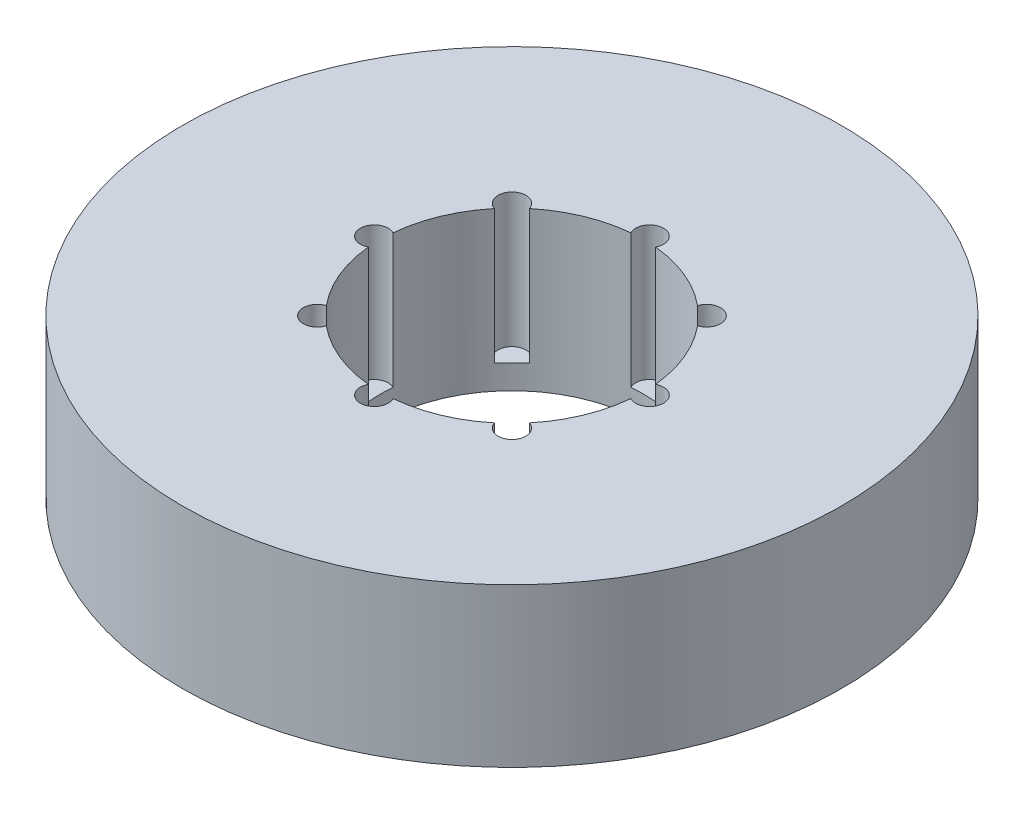
ISO-10303-21;
HEADER;
FILE_DESCRIPTION(('STEP AP214'),'2;1');
FILE_NAME('part.step','',(''),(''),'','','');
FILE_SCHEMA(('AUTOMOTIVE_DESIGN { 1 0 10303 214 1 1 1 1 }'));
ENDSEC;
DATA;
#1=APPLICATION_CONTEXT('core data for automotive mechanical design processes');
#2=APPLICATION_PROTOCOL_DEFINITION('international standard','automotive_design',2000,#1);
#3=PRODUCT_CONTEXT('',#1,'mechanical');
#4=PRODUCT('Part','Part','',(#3));
#5=PRODUCT_RELATED_PRODUCT_CATEGORY('part','',(#4));
#6=PRODUCT_DEFINITION_FORMATION('','',#4);
#7=PRODUCT_DEFINITION_CONTEXT('part definition',#1,'design');
#8=PRODUCT_DEFINITION('design','',#6,#7);
#9=PRODUCT_DEFINITION_SHAPE('','',#8);
#10=(LENGTH_UNIT() NAMED_UNIT(*) SI_UNIT(.MILLI.,.METRE.));
#11=(NAMED_UNIT(*) PLANE_ANGLE_UNIT() SI_UNIT($,.RADIAN.));
#12=(NAMED_UNIT(*) SI_UNIT($,.STERADIAN.) SOLID_ANGLE_UNIT());
#13=UNCERTAINTY_MEASURE_WITH_UNIT(LENGTH_MEASURE(1.E-05),#10,'distance_accuracy_value','');
#14=(GEOMETRIC_REPRESENTATION_CONTEXT(3) GLOBAL_UNCERTAINTY_ASSIGNED_CONTEXT((#13)) GLOBAL_UNIT_ASSIGNED_CONTEXT((#10,
#11,#12)) REPRESENTATION_CONTEXT('',''));
#15=CARTESIAN_POINT('',(0.,0.,0.));
#16=DIRECTION('',(0.,0.,1.));
#17=DIRECTION('',(1.,0.,0.));
#18=AXIS2_PLACEMENT_3D('',#15,#16,#17);
#19=CARTESIAN_POINT('',(0.,30.,0.));
#20=DIRECTION('',(0.,-1.,0.));
#21=DIRECTION('',(0.,0.,-1.));
#22=AXIS2_PLACEMENT_3D('',#19,#20,#21);
#23=CYLINDRICAL_SURFACE('',#22,62.5);
#24=CARTESIAN_POINT('',(0.,30.,0.));
#25=DIRECTION('',(0.,1.,0.));
#26=DIRECTION('',(0.,0.,1.));
#27=AXIS2_PLACEMENT_3D('',#24,#25,#26);
#28=CIRCLE('',#27,62.5);
#29=CARTESIAN_POINT('',(0.,30.,62.5));
#30=VERTEX_POINT('',#29);
#31=EDGE_CURVE('E195',#30,#30,#28,.T.);
#32=ORIENTED_EDGE('',*,*,#31,.F.);
#33=EDGE_LOOP('',(#32));
#34=FACE_BOUND('',#33,.T.);
#35=CARTESIAN_POINT('',(0.,0.,0.));
#36=DIRECTION('',(0.,1.,0.));
#37=DIRECTION('',(0.,0.,1.));
#38=AXIS2_PLACEMENT_3D('',#35,#36,#37);
#39=CIRCLE('',#38,62.5);
#40=CARTESIAN_POINT('',(0.,0.,62.5));
#41=VERTEX_POINT('',#40);
#42=EDGE_CURVE('E179',#41,#41,#39,.T.);
#43=ORIENTED_EDGE('',*,*,#42,.T.);
#44=EDGE_LOOP('',(#43));
#45=FACE_BOUND('',#44,.T.);
#46=ADVANCED_FACE('F39',(#34,#45),#23,.T.);
#47=CARTESIAN_POINT('',(0.,30.,0.));
#48=DIRECTION('',(0.,1.,0.));
#49=DIRECTION('',(0.,0.,1.));
#50=AXIS2_PLACEMENT_3D('',#47,#48,#49);
#51=PLANE('',#50);
#52=CARTESIAN_POINT('',(0.,30.,26.1063703880991));
#53=DIRECTION('',(0.,1.,0.));
#54=DIRECTION('',(1.,0.,0.));
#55=AXIS2_PLACEMENT_3D('',#52,#53,#54);
#56=CIRCLE('',#55,2.64043993435413);
#57=CARTESIAN_POINT('',(-2.34353536969357,30.,24.8899144629104));
#58=VERTEX_POINT('',#57);
#59=CARTESIAN_POINT('',(2.34353536969374,30.,24.8899144629104));
#60=VERTEX_POINT('',#59);
#61=EDGE_CURVE('E176',#58,#60,#56,.T.);
#62=ORIENTED_EDGE('',*,*,#61,.F.);
#63=CARTESIAN_POINT('',(0.,30.,0.));
#64=DIRECTION('',(0.,1.,0.));
#65=DIRECTION('',(0.,0.,1.));
#66=AXIS2_PLACEMENT_3D('',#63,#64,#65);
#67=CIRCLE('',#66,25.);
#68=CARTESIAN_POINT('',(-15.9426975480161,30.,19.256957051738));
#69=VERTEX_POINT('',#68);
#70=EDGE_CURVE('E166',#69,#58,#67,.T.);
#71=ORIENTED_EDGE('',*,*,#70,.F.);
#72=CARTESIAN_POINT('',(-18.4599915335926,30.,18.4599915335926));
#73=DIRECTION('',(0.,1.,0.));
#74=DIRECTION('',(0.707106781186549,0.,0.707106781186546));
#75=AXIS2_PLACEMENT_3D('',#72,#73,#74);
#76=CIRCLE('',#75,2.64043993435413);
#77=CARTESIAN_POINT('',(-19.2569570517379,30.,15.9426975480162));
#78=VERTEX_POINT('',#77);
#79=EDGE_CURVE('E147',#78,#69,#76,.T.);
#80=ORIENTED_EDGE('',*,*,#79,.F.);
#81=CARTESIAN_POINT('',(-24.8899144629104,30.,2.34353536969365));
#82=VERTEX_POINT('',#81);
#83=EDGE_CURVE('E180',#82,#78,#67,.T.);
#84=ORIENTED_EDGE('',*,*,#83,.F.);
#85=CARTESIAN_POINT('',(-26.1063703880991,30.,0.));
#86=DIRECTION('',(0.,1.,0.));
#87=DIRECTION('',(0.,0.,1.));
#88=AXIS2_PLACEMENT_3D('',#85,#86,#87);
#89=CIRCLE('',#88,2.64043993435413);
#90=CARTESIAN_POINT('',(-24.8899144629104,30.,-2.34353536969365));
#91=VERTEX_POINT('',#90);
#92=EDGE_CURVE('E186',#91,#82,#89,.T.);
#93=ORIENTED_EDGE('',*,*,#92,.F.);
#94=CARTESIAN_POINT('',(-19.2569570517381,30.,-15.9426975480159));
#95=VERTEX_POINT('',#94);
#96=EDGE_CURVE('E182',#95,#91,#67,.T.);
#97=ORIENTED_EDGE('',*,*,#96,.F.);
#98=CARTESIAN_POINT('',(-18.4599915335928,30.,-18.4599915335924));
#99=DIRECTION('',(0.,1.,0.));
#100=DIRECTION('',(-0.707106781186539,0.,0.707106781186556));
#101=AXIS2_PLACEMENT_3D('',#98,#99,#100);
#102=CIRCLE('',#101,2.64043993435413);
#103=CARTESIAN_POINT('',(-15.9426975480164,30.,-19.2569570517378));
#104=VERTEX_POINT('',#103);
#105=EDGE_CURVE('E446',#104,#95,#102,.T.);
#106=ORIENTED_EDGE('',*,*,#105,.F.);
#107=CARTESIAN_POINT('',(-2.34353536969392,30.,-24.8899144629103));
#108=VERTEX_POINT('',#107);
#109=EDGE_CURVE('E452',#108,#104,#67,.T.);
#110=ORIENTED_EDGE('',*,*,#109,.F.);
#111=CARTESIAN_POINT('',(-2.73449715104925E-13,30.,-26.1063703880991));
#112=DIRECTION('',(0.,1.,0.));
#113=DIRECTION('',(-1.,0.,0.));
#114=AXIS2_PLACEMENT_3D('',#111,#112,#113);
#115=CIRCLE('',#114,2.64043993435413);
#116=CARTESIAN_POINT('',(2.34353536969339,30.,-24.8899144629104));
#117=VERTEX_POINT('',#116);
#118=EDGE_CURVE('E477',#117,#108,#115,.T.);
#119=ORIENTED_EDGE('',*,*,#118,.F.);
#120=CARTESIAN_POINT('',(15.942697548016,30.,-19.2569570517381));
#121=VERTEX_POINT('',#120);
#122=EDGE_CURVE('E460',#121,#117,#67,.T.);
#123=ORIENTED_EDGE('',*,*,#122,.F.);
#124=CARTESIAN_POINT('',(18.4599915335924,30.,-18.4599915335927));
#125=DIRECTION('',(0.,1.,0.));
#126=DIRECTION('',(-0.707106781186554,0.,-0.707106781186541));
#127=AXIS2_PLACEMENT_3D('',#124,#125,#126);
#128=CIRCLE('',#127,2.64043993435413);
#129=CARTESIAN_POINT('',(19.2569570517378,30.,-15.9426975480163));
#130=VERTEX_POINT('',#129);
#131=EDGE_CURVE('E464',#130,#121,#128,.T.);
#132=ORIENTED_EDGE('',*,*,#131,.F.);
#133=CARTESIAN_POINT('',(24.8899144629104,30.,-2.34353536969365));
#134=VERTEX_POINT('',#133);
#135=EDGE_CURVE('E459',#134,#130,#67,.T.);
#136=ORIENTED_EDGE('',*,*,#135,.F.);
#137=CARTESIAN_POINT('',(26.1063703880991,30.,0.));
#138=DIRECTION('',(0.,1.,0.));
#139=DIRECTION('',(0.,0.,-1.));
#140=AXIS2_PLACEMENT_3D('',#137,#138,#139);
#141=CIRCLE('',#140,2.64043993435413);
#142=CARTESIAN_POINT('',(24.8899144629104,30.,2.34353536969365));
#143=VERTEX_POINT('',#142);
#144=EDGE_CURVE('E469',#143,#134,#141,.T.);
#145=ORIENTED_EDGE('',*,*,#144,.F.);
#146=CARTESIAN_POINT('',(19.256957051738,30.,15.942697548016));
#147=VERTEX_POINT('',#146);
#148=EDGE_CURVE('E181',#147,#143,#67,.T.);
#149=ORIENTED_EDGE('',*,*,#148,.F.);
#150=CARTESIAN_POINT('',(18.4599915335927,30.,18.4599915335925));
#151=DIRECTION('',(0.,1.,0.));
#152=DIRECTION('',(0.707106781186544,0.,-0.707106781186551));
#153=AXIS2_PLACEMENT_3D('',#150,#151,#152);
#154=CIRCLE('',#153,2.64043993435413);
#155=CARTESIAN_POINT('',(15.9426975480162,30.,19.2569570517379));
#156=VERTEX_POINT('',#155);
#157=EDGE_CURVE('E475',#156,#147,#154,.T.);
#158=ORIENTED_EDGE('',*,*,#157,.F.);
#159=EDGE_CURVE('E177',#60,#156,#67,.T.);
#160=ORIENTED_EDGE('',*,*,#159,.F.);
#161=EDGE_LOOP('',(#62,#71,#80,#84,#93,#97,#106,#110,#119,#123,#132,#136,#145,#149,#158,#160));
#162=FACE_BOUND('',#161,.T.);
#163=ORIENTED_EDGE('',*,*,#31,.T.);
#164=EDGE_LOOP('',(#163));
#165=FACE_BOUND('',#164,.T.);
#166=ADVANCED_FACE('F172',(#162,#165),#51,.T.);
#167=CARTESIAN_POINT('',(0.,0.,0.));
#168=DIRECTION('',(0.,1.,0.));
#169=DIRECTION('',(0.,0.,1.));
#170=AXIS2_PLACEMENT_3D('',#167,#168,#169);
#171=PLANE('',#170);
#172=CARTESIAN_POINT('',(0.,0.,0.));
#173=DIRECTION('',(0.,1.,0.));
#174=DIRECTION('',(0.,0.,1.));
#175=AXIS2_PLACEMENT_3D('',#172,#173,#174);
#176=CIRCLE('',#175,25.);
#177=CARTESIAN_POINT('',(0.,0.,25.));
#178=VERTEX_POINT('',#177);
#179=EDGE_CURVE('E187',#178,#178,#176,.T.);
#180=ORIENTED_EDGE('',*,*,#179,.T.);
#181=EDGE_LOOP('',(#180));
#182=FACE_BOUND('',#181,.T.);
#183=ORIENTED_EDGE('',*,*,#42,.F.);
#184=EDGE_LOOP('',(#183));
#185=FACE_BOUND('',#184,.T.);
#186=ADVANCED_FACE('F270',(#182,#185),#171,.F.);
#187=CARTESIAN_POINT('',(0.,30.,0.));
#188=DIRECTION('',(0.,-1.,0.));
#189=DIRECTION('',(0.,0.,-1.));
#190=AXIS2_PLACEMENT_3D('',#187,#188,#189);
#191=CYLINDRICAL_SURFACE('',#190,25.);
#192=DIRECTION('',(0.,1.,0.));
#193=VECTOR('',#192,1.);
#194=CARTESIAN_POINT('',(-2.34353536969358,17.3003729267506,24.8899144629104));
#195=LINE('',#194,#193);
#196=CARTESIAN_POINT('',(-2.34353536969357,4.60074585350113,24.8899144629104));
#197=VERTEX_POINT('',#196);
#198=EDGE_CURVE('E11',#197,#58,#195,.T.);
#199=ORIENTED_EDGE('',*,*,#198,.F.);
#200=CARTESIAN_POINT('',(0.,4.60074585350113,0.));
#201=DIRECTION('',(0.,1.,0.));
#202=DIRECTION('',(0.,0.,1.));
#203=AXIS2_PLACEMENT_3D('',#200,#201,#202);
#204=CIRCLE('',#203,25.);
#205=CARTESIAN_POINT('',(2.34353536969374,4.60074585350113,24.8899144629104));
#206=VERTEX_POINT('',#205);
#207=EDGE_CURVE('E250',#197,#206,#204,.T.);
#208=ORIENTED_EDGE('',*,*,#207,.T.);
#209=DIRECTION('',(0.,1.,0.));
#210=VECTOR('',#209,1.);
#211=CARTESIAN_POINT('',(2.34353536969375,17.3003729267506,24.8899144629104));
#212=LINE('',#211,#210);
#213=EDGE_CURVE('E46',#60,#206,#212,.F.);
#214=ORIENTED_EDGE('',*,*,#213,.F.);
#215=ORIENTED_EDGE('',*,*,#159,.T.);
#216=DIRECTION('',(0.,1.,0.));
#217=VECTOR('',#216,1.);
#218=CARTESIAN_POINT('',(15.9426975480162,17.3003729267506,19.2569570517379));
#219=LINE('',#218,#217);
#220=CARTESIAN_POINT('',(15.9426975480162,4.60074585350113,19.2569570517379));
#221=VERTEX_POINT('',#220);
#222=EDGE_CURVE('E244',#221,#156,#219,.T.);
#223=ORIENTED_EDGE('',*,*,#222,.F.);
#224=CARTESIAN_POINT('',(0.,4.60074585350113,0.));
#225=DIRECTION('',(0.,1.,0.));
#226=DIRECTION('',(0.,0.,1.));
#227=AXIS2_PLACEMENT_3D('',#224,#225,#226);
#228=CIRCLE('',#227,25.);
#229=CARTESIAN_POINT('',(19.256957051738,4.60074585350113,15.942697548016));
#230=VERTEX_POINT('',#229);
#231=EDGE_CURVE('E238',#221,#230,#228,.T.);
#232=ORIENTED_EDGE('',*,*,#231,.T.);
#233=DIRECTION('',(0.,1.,0.));
#234=VECTOR('',#233,1.);
#235=CARTESIAN_POINT('',(19.2569570517381,17.3003729267506,15.942697548016));
#236=LINE('',#235,#234);
#237=EDGE_CURVE('E242',#147,#230,#236,.F.);
#238=ORIENTED_EDGE('',*,*,#237,.F.);
#239=ORIENTED_EDGE('',*,*,#148,.T.);
#240=DIRECTION('',(0.,1.,0.));
#241=VECTOR('',#240,1.);
#242=CARTESIAN_POINT('',(24.8899144629104,17.3003729267506,2.34353536969367));
#243=LINE('',#242,#241);
#244=CARTESIAN_POINT('',(24.8899144629104,4.60074585350113,2.34353536969365));
#245=VERTEX_POINT('',#244);
#246=EDGE_CURVE('E236',#245,#143,#243,.T.);
#247=ORIENTED_EDGE('',*,*,#246,.F.);
#248=CARTESIAN_POINT('',(0.,4.60074585350113,0.));
#249=DIRECTION('',(0.,1.,0.));
#250=DIRECTION('',(0.,0.,1.));
#251=AXIS2_PLACEMENT_3D('',#248,#249,#250);
#252=CIRCLE('',#251,25.);
#253=CARTESIAN_POINT('',(24.8899144629104,4.60074585350113,-2.34353536969365));
#254=VERTEX_POINT('',#253);
#255=EDGE_CURVE('E235',#245,#254,#252,.T.);
#256=ORIENTED_EDGE('',*,*,#255,.T.);
#257=DIRECTION('',(0.,1.,0.));
#258=VECTOR('',#257,1.);
#259=CARTESIAN_POINT('',(24.8899144629104,17.3003729267506,-2.34353536969367));
#260=LINE('',#259,#258);
#261=EDGE_CURVE('E234',#134,#254,#260,.F.);
#262=ORIENTED_EDGE('',*,*,#261,.F.);
#263=ORIENTED_EDGE('',*,*,#135,.T.);
#264=DIRECTION('',(0.,1.,0.));
#265=VECTOR('',#264,1.);
#266=CARTESIAN_POINT('',(19.2569570517378,17.3003729267506,-15.9426975480163));
#267=LINE('',#266,#265);
#268=CARTESIAN_POINT('',(19.2569570517378,4.60074585350113,-15.9426975480163));
#269=VERTEX_POINT('',#268);
#270=EDGE_CURVE('E229',#269,#130,#267,.T.);
#271=ORIENTED_EDGE('',*,*,#270,.F.);
#272=CARTESIAN_POINT('',(0.,4.60074585350113,0.));
#273=DIRECTION('',(0.,1.,0.));
#274=DIRECTION('',(0.,0.,1.));
#275=AXIS2_PLACEMENT_3D('',#272,#273,#274);
#276=CIRCLE('',#275,25.);
#277=CARTESIAN_POINT('',(15.942697548016,4.60074585350113,-19.2569570517381));
#278=VERTEX_POINT('',#277);
#279=EDGE_CURVE('E221',#269,#278,#276,.T.);
#280=ORIENTED_EDGE('',*,*,#279,.T.);
#281=DIRECTION('',(0.,1.,0.));
#282=VECTOR('',#281,1.);
#283=CARTESIAN_POINT('',(15.942697548016,17.3003729267506,-19.2569570517381));
#284=LINE('',#283,#282);
#285=EDGE_CURVE('E230',#121,#278,#284,.F.);
#286=ORIENTED_EDGE('',*,*,#285,.F.);
#287=ORIENTED_EDGE('',*,*,#122,.T.);
#288=DIRECTION('',(0.,1.,0.));
#289=VECTOR('',#288,1.);
#290=CARTESIAN_POINT('',(2.3435353696934,17.3003729267506,-24.8899144629104));
#291=LINE('',#290,#289);
#292=CARTESIAN_POINT('',(2.34353536969339,4.60074585350113,-24.8899144629104));
#293=VERTEX_POINT('',#292);
#294=EDGE_CURVE('E225',#293,#117,#291,.T.);
#295=ORIENTED_EDGE('',*,*,#294,.F.);
#296=CARTESIAN_POINT('',(0.,4.60074585350113,0.));
#297=DIRECTION('',(0.,1.,0.));
#298=DIRECTION('',(0.,0.,1.));
#299=AXIS2_PLACEMENT_3D('',#296,#297,#298);
#300=CIRCLE('',#299,25.);
#301=CARTESIAN_POINT('',(-2.34353536969392,4.60074585350113,-24.8899144629103));
#302=VERTEX_POINT('',#301);
#303=EDGE_CURVE('E216',#293,#302,#300,.T.);
#304=ORIENTED_EDGE('',*,*,#303,.T.);
#305=DIRECTION('',(0.,1.,0.));
#306=VECTOR('',#305,1.);
#307=CARTESIAN_POINT('',(-2.34353536969393,17.3003729267506,-24.8899144629104));
#308=LINE('',#307,#306);
#309=EDGE_CURVE('E218',#108,#302,#308,.F.);
#310=ORIENTED_EDGE('',*,*,#309,.F.);
#311=ORIENTED_EDGE('',*,*,#109,.T.);
#312=DIRECTION('',(0.,1.,0.));
#313=VECTOR('',#312,1.);
#314=CARTESIAN_POINT('',(-15.9426975480164,17.3003729267506,-19.2569570517378));
#315=LINE('',#314,#313);
#316=CARTESIAN_POINT('',(-15.9426975480164,4.60074585350113,-19.2569570517378));
#317=VERTEX_POINT('',#316);
#318=EDGE_CURVE('E212',#317,#104,#315,.T.);
#319=ORIENTED_EDGE('',*,*,#318,.F.);
#320=CARTESIAN_POINT('',(0.,4.60074585350113,0.));
#321=DIRECTION('',(0.,1.,0.));
#322=DIRECTION('',(0.,0.,1.));
#323=AXIS2_PLACEMENT_3D('',#320,#321,#322);
#324=CIRCLE('',#323,25.);
#325=CARTESIAN_POINT('',(-19.2569570517381,4.60074585350113,-15.9426975480159));
#326=VERTEX_POINT('',#325);
#327=EDGE_CURVE('E208',#317,#326,#324,.T.);
#328=ORIENTED_EDGE('',*,*,#327,.T.);
#329=DIRECTION('',(0.,1.,0.));
#330=VECTOR('',#329,1.);
#331=CARTESIAN_POINT('',(-19.2569570517382,17.3003729267506,-15.9426975480159));
#332=LINE('',#331,#330);
#333=EDGE_CURVE('E211',#95,#326,#332,.F.);
#334=ORIENTED_EDGE('',*,*,#333,.F.);
#335=ORIENTED_EDGE('',*,*,#96,.T.);
#336=DIRECTION('',(0.,1.,0.));
#337=VECTOR('',#336,1.);
#338=CARTESIAN_POINT('',(-24.8899144629104,17.3003729267506,-2.34353536969367));
#339=LINE('',#338,#337);
#340=CARTESIAN_POINT('',(-24.8899144629104,4.60074585350113,-2.34353536969365));
#341=VERTEX_POINT('',#340);
#342=EDGE_CURVE('E201',#341,#91,#339,.T.);
#343=ORIENTED_EDGE('',*,*,#342,.F.);
#344=CARTESIAN_POINT('',(0.,4.60074585350113,0.));
#345=DIRECTION('',(0.,1.,0.));
#346=DIRECTION('',(0.,0.,1.));
#347=AXIS2_PLACEMENT_3D('',#344,#345,#346);
#348=CIRCLE('',#347,25.);
#349=CARTESIAN_POINT('',(-24.8899144629104,4.60074585350113,2.34353536969365));
#350=VERTEX_POINT('',#349);
#351=EDGE_CURVE('E194',#341,#350,#348,.T.);
#352=ORIENTED_EDGE('',*,*,#351,.T.);
#353=DIRECTION('',(0.,1.,0.));
#354=VECTOR('',#353,1.);
#355=CARTESIAN_POINT('',(-24.8899144629104,17.3003729267506,2.34353536969367));
#356=LINE('',#355,#354);
#357=EDGE_CURVE('E199',#82,#350,#356,.F.);
#358=ORIENTED_EDGE('',*,*,#357,.F.);
#359=ORIENTED_EDGE('',*,*,#83,.T.);
#360=DIRECTION('',(0.,1.,0.));
#361=VECTOR('',#360,1.);
#362=CARTESIAN_POINT('',(-19.2569570517379,17.3003729267506,15.9426975480162));
#363=LINE('',#362,#361);
#364=CARTESIAN_POINT('',(-19.2569570517379,4.60074585350113,15.9426975480162));
#365=VERTEX_POINT('',#364);
#366=EDGE_CURVE('E160',#365,#78,#363,.T.);
#367=ORIENTED_EDGE('',*,*,#366,.F.);
#368=CARTESIAN_POINT('',(0.,4.60074585350113,0.));
#369=DIRECTION('',(0.,1.,0.));
#370=DIRECTION('',(0.,0.,1.));
#371=AXIS2_PLACEMENT_3D('',#368,#369,#370);
#372=CIRCLE('',#371,25.);
#373=CARTESIAN_POINT('',(-15.9426975480161,4.60074585350113,19.256957051738));
#374=VERTEX_POINT('',#373);
#375=EDGE_CURVE('E168',#365,#374,#372,.T.);
#376=ORIENTED_EDGE('',*,*,#375,.T.);
#377=DIRECTION('',(0.,1.,0.));
#378=VECTOR('',#377,1.);
#379=CARTESIAN_POINT('',(-15.9426975480161,17.3003729267506,19.256957051738));
#380=LINE('',#379,#378);
#381=EDGE_CURVE('E152',#69,#374,#380,.F.);
#382=ORIENTED_EDGE('',*,*,#381,.F.);
#383=ORIENTED_EDGE('',*,*,#70,.T.);
#384=EDGE_LOOP('',(#199,#208,#214,#215,#223,#232,#238,#239,#247,#256,#262,#263,#271,#280,#286,
#287,#295,#304,#310,#311,#319,#328,#334,#335,#343,#352,#358,#359,#367,#376,#382,#383));
#385=FACE_BOUND('',#384,.T.);
#386=ORIENTED_EDGE('',*,*,#179,.F.);
#387=EDGE_LOOP('',(#386));
#388=FACE_BOUND('',#387,.T.);
#389=ADVANCED_FACE('F170',(#385,#388),#191,.F.);
#390=CARTESIAN_POINT('',(-26.1063703880991,4.60074585350113,0.));
#391=DIRECTION('',(0.,1.,0.));
#392=DIRECTION('',(0.,0.,1.));
#393=AXIS2_PLACEMENT_3D('',#390,#391,#392);
#394=CYLINDRICAL_SURFACE('',#393,2.64043993435413);
#395=ORIENTED_EDGE('',*,*,#342,.T.);
#396=ORIENTED_EDGE('',*,*,#92,.T.);
#397=ORIENTED_EDGE('',*,*,#357,.T.);
#398=CARTESIAN_POINT('',(-26.1063703880991,4.60074585350113,0.));
#399=DIRECTION('',(0.,1.,0.));
#400=DIRECTION('',(0.,0.,1.));
#401=AXIS2_PLACEMENT_3D('',#398,#399,#400);
#402=CIRCLE('',#401,2.64043993435413);
#403=EDGE_CURVE('E191',#341,#350,#402,.T.);
#404=ORIENTED_EDGE('',*,*,#403,.F.);
#405=EDGE_LOOP('',(#395,#396,#397,#404));
#406=FACE_BOUND('',#405,.T.);
#407=ADVANCED_FACE('F279',(#406),#394,.F.);
#408=CARTESIAN_POINT('',(-26.1063703880991,4.60074585350113,0.));
#409=DIRECTION('',(0.,1.,0.));
#410=DIRECTION('',(0.,0.,1.));
#411=AXIS2_PLACEMENT_3D('',#408,#409,#410);
#412=PLANE('',#411);
#413=ORIENTED_EDGE('',*,*,#403,.T.);
#414=ORIENTED_EDGE('',*,*,#351,.F.);
#415=EDGE_LOOP('',(#413,#414));
#416=FACE_BOUND('',#415,.T.);
#417=ADVANCED_FACE('F285',(#416),#412,.T.);
#418=CARTESIAN_POINT('',(-18.4599915335926,4.60074585350113,18.4599915335926));
#419=DIRECTION('',(0.,1.,0.));
#420=DIRECTION('',(0.,0.,1.));
#421=AXIS2_PLACEMENT_3D('',#418,#419,#420);
#422=CYLINDRICAL_SURFACE('',#421,2.64043993435413);
#423=ORIENTED_EDGE('',*,*,#366,.T.);
#424=ORIENTED_EDGE('',*,*,#79,.T.);
#425=ORIENTED_EDGE('',*,*,#381,.T.);
#426=CARTESIAN_POINT('',(-18.4599915335926,4.60074585350113,18.4599915335926));
#427=DIRECTION('',(0.,1.,0.));
#428=DIRECTION('',(0.707106781186549,0.,0.707106781186546));
#429=AXIS2_PLACEMENT_3D('',#426,#427,#428);
#430=CIRCLE('',#429,2.64043993435413);
#431=EDGE_CURVE('E165',#365,#374,#430,.T.);
#432=ORIENTED_EDGE('',*,*,#431,.F.);
#433=EDGE_LOOP('',(#423,#424,#425,#432));
#434=FACE_BOUND('',#433,.T.);
#435=ADVANCED_FACE('F155',(#434),#422,.F.);
#436=CARTESIAN_POINT('',(-18.4599915335926,4.60074585350113,18.4599915335926));
#437=DIRECTION('',(0.,1.,0.));
#438=DIRECTION('',(0.707106781186549,0.,0.707106781186546));
#439=AXIS2_PLACEMENT_3D('',#436,#437,#438);
#440=PLANE('',#439);
#441=ORIENTED_EDGE('',*,*,#431,.T.);
#442=ORIENTED_EDGE('',*,*,#375,.F.);
#443=EDGE_LOOP('',(#441,#442));
#444=FACE_BOUND('',#443,.T.);
#445=ADVANCED_FACE('F288',(#444),#440,.T.);
#446=CARTESIAN_POINT('',(-18.4599915335928,4.60074585350113,-18.4599915335924));
#447=DIRECTION('',(0.,1.,0.));
#448=DIRECTION('',(0.,0.,1.));
#449=AXIS2_PLACEMENT_3D('',#446,#447,#448);
#450=CYLINDRICAL_SURFACE('',#449,2.64043993435413);
#451=ORIENTED_EDGE('',*,*,#318,.T.);
#452=ORIENTED_EDGE('',*,*,#105,.T.);
#453=ORIENTED_EDGE('',*,*,#333,.T.);
#454=CARTESIAN_POINT('',(-18.4599915335928,4.60074585350113,-18.4599915335924));
#455=DIRECTION('',(0.,1.,0.));
#456=DIRECTION('',(-0.707106781186539,0.,0.707106781186556));
#457=AXIS2_PLACEMENT_3D('',#454,#455,#456);
#458=CIRCLE('',#457,2.64043993435413);
#459=EDGE_CURVE('E447',#317,#326,#458,.T.);
#460=ORIENTED_EDGE('',*,*,#459,.F.);
#461=EDGE_LOOP('',(#451,#452,#453,#460));
#462=FACE_BOUND('',#461,.T.);
#463=ADVANCED_FACE('F295',(#462),#450,.F.);
#464=CARTESIAN_POINT('',(-18.4599915335928,4.60074585350113,-18.4599915335924));
#465=DIRECTION('',(0.,1.,0.));
#466=DIRECTION('',(-0.707106781186539,0.,0.707106781186556));
#467=AXIS2_PLACEMENT_3D('',#464,#465,#466);
#468=PLANE('',#467);
#469=ORIENTED_EDGE('',*,*,#459,.T.);
#470=ORIENTED_EDGE('',*,*,#327,.F.);
#471=EDGE_LOOP('',(#469,#470));
#472=FACE_BOUND('',#471,.T.);
#473=ADVANCED_FACE('F375',(#472),#468,.T.);
#474=CARTESIAN_POINT('',(-2.73449715104925E-13,4.60074585350113,-26.1063703880991));
#475=DIRECTION('',(0.,1.,0.));
#476=DIRECTION('',(0.,0.,1.));
#477=AXIS2_PLACEMENT_3D('',#474,#475,#476);
#478=CYLINDRICAL_SURFACE('',#477,2.64043993435413);
#479=ORIENTED_EDGE('',*,*,#294,.T.);
#480=ORIENTED_EDGE('',*,*,#118,.T.);
#481=ORIENTED_EDGE('',*,*,#309,.T.);
#482=CARTESIAN_POINT('',(-2.73449715104925E-13,4.60074585350113,-26.1063703880991));
#483=DIRECTION('',(0.,1.,0.));
#484=DIRECTION('',(-1.,0.,0.));
#485=AXIS2_PLACEMENT_3D('',#482,#483,#484);
#486=CIRCLE('',#485,2.64043993435413);
#487=EDGE_CURVE('E467',#293,#302,#486,.T.);
#488=ORIENTED_EDGE('',*,*,#487,.F.);
#489=EDGE_LOOP('',(#479,#480,#481,#488));
#490=FACE_BOUND('',#489,.T.);
#491=ADVANCED_FACE('F361',(#490),#478,.F.);
#492=CARTESIAN_POINT('',(-2.73449715104925E-13,4.60074585350113,-26.1063703880991));
#493=DIRECTION('',(0.,1.,0.));
#494=DIRECTION('',(-1.,0.,0.));
#495=AXIS2_PLACEMENT_3D('',#492,#493,#494);
#496=PLANE('',#495);
#497=ORIENTED_EDGE('',*,*,#487,.T.);
#498=ORIENTED_EDGE('',*,*,#303,.F.);
#499=EDGE_LOOP('',(#497,#498));
#500=FACE_BOUND('',#499,.T.);
#501=ADVANCED_FACE('F297',(#500),#496,.T.);
#502=CARTESIAN_POINT('',(18.4599915335924,4.60074585350113,-18.4599915335927));
#503=DIRECTION('',(0.,1.,0.));
#504=DIRECTION('',(0.,0.,1.));
#505=AXIS2_PLACEMENT_3D('',#502,#503,#504);
#506=CYLINDRICAL_SURFACE('',#505,2.64043993435413);
#507=ORIENTED_EDGE('',*,*,#270,.T.);
#508=ORIENTED_EDGE('',*,*,#131,.T.);
#509=ORIENTED_EDGE('',*,*,#285,.T.);
#510=CARTESIAN_POINT('',(18.4599915335924,4.60074585350113,-18.4599915335927));
#511=DIRECTION('',(0.,1.,0.));
#512=DIRECTION('',(-0.707106781186554,0.,-0.707106781186541));
#513=AXIS2_PLACEMENT_3D('',#510,#511,#512);
#514=CIRCLE('',#513,2.64043993435413);
#515=EDGE_CURVE('E470',#269,#278,#514,.T.);
#516=ORIENTED_EDGE('',*,*,#515,.F.);
#517=EDGE_LOOP('',(#507,#508,#509,#516));
#518=FACE_BOUND('',#517,.T.);
#519=ADVANCED_FACE('F294',(#518),#506,.F.);
#520=CARTESIAN_POINT('',(18.4599915335924,4.60074585350113,-18.4599915335927));
#521=DIRECTION('',(0.,1.,0.));
#522=DIRECTION('',(-0.707106781186554,0.,-0.707106781186541));
#523=AXIS2_PLACEMENT_3D('',#520,#521,#522);
#524=PLANE('',#523);
#525=ORIENTED_EDGE('',*,*,#515,.T.);
#526=ORIENTED_EDGE('',*,*,#279,.F.);
#527=EDGE_LOOP('',(#525,#526));
#528=FACE_BOUND('',#527,.T.);
#529=ADVANCED_FACE('F300',(#528),#524,.T.);
#530=CARTESIAN_POINT('',(26.1063703880991,4.60074585350113,0.));
#531=DIRECTION('',(0.,1.,0.));
#532=DIRECTION('',(0.,0.,1.));
#533=AXIS2_PLACEMENT_3D('',#530,#531,#532);
#534=CYLINDRICAL_SURFACE('',#533,2.64043993435413);
#535=ORIENTED_EDGE('',*,*,#246,.T.);
#536=ORIENTED_EDGE('',*,*,#144,.T.);
#537=ORIENTED_EDGE('',*,*,#261,.T.);
#538=CARTESIAN_POINT('',(26.1063703880991,4.60074585350113,0.));
#539=DIRECTION('',(0.,1.,0.));
#540=DIRECTION('',(0.,0.,-1.));
#541=AXIS2_PLACEMENT_3D('',#538,#539,#540);
#542=CIRCLE('',#541,2.64043993435413);
#543=EDGE_CURVE('E472',#245,#254,#542,.T.);
#544=ORIENTED_EDGE('',*,*,#543,.F.);
#545=EDGE_LOOP('',(#535,#536,#537,#544));
#546=FACE_BOUND('',#545,.T.);
#547=ADVANCED_FACE('F305',(#546),#534,.F.);
#548=CARTESIAN_POINT('',(26.1063703880991,4.60074585350113,0.));
#549=DIRECTION('',(0.,1.,0.));
#550=DIRECTION('',(0.,0.,-1.));
#551=AXIS2_PLACEMENT_3D('',#548,#549,#550);
#552=PLANE('',#551);
#553=ORIENTED_EDGE('',*,*,#543,.T.);
#554=ORIENTED_EDGE('',*,*,#255,.F.);
#555=EDGE_LOOP('',(#553,#554));
#556=FACE_BOUND('',#555,.T.);
#557=ADVANCED_FACE('F308',(#556),#552,.T.);
#558=CARTESIAN_POINT('',(18.4599915335927,4.60074585350113,18.4599915335925));
#559=DIRECTION('',(0.,1.,0.));
#560=DIRECTION('',(0.,0.,1.));
#561=AXIS2_PLACEMENT_3D('',#558,#559,#560);
#562=CYLINDRICAL_SURFACE('',#561,2.64043993435413);
#563=ORIENTED_EDGE('',*,*,#222,.T.);
#564=ORIENTED_EDGE('',*,*,#157,.T.);
#565=ORIENTED_EDGE('',*,*,#237,.T.);
#566=CARTESIAN_POINT('',(18.4599915335927,4.60074585350113,18.4599915335925));
#567=DIRECTION('',(0.,1.,0.));
#568=DIRECTION('',(0.707106781186544,0.,-0.707106781186551));
#569=AXIS2_PLACEMENT_3D('',#566,#567,#568);
#570=CIRCLE('',#569,2.64043993435413);
#571=EDGE_CURVE('E56',#221,#230,#570,.T.);
#572=ORIENTED_EDGE('',*,*,#571,.F.);
#573=EDGE_LOOP('',(#563,#564,#565,#572));
#574=FACE_BOUND('',#573,.T.);
#575=ADVANCED_FACE('F309',(#574),#562,.F.);
#576=CARTESIAN_POINT('',(18.4599915335927,4.60074585350113,18.4599915335925));
#577=DIRECTION('',(0.,1.,0.));
#578=DIRECTION('',(0.707106781186544,0.,-0.707106781186551));
#579=AXIS2_PLACEMENT_3D('',#576,#577,#578);
#580=PLANE('',#579);
#581=ORIENTED_EDGE('',*,*,#571,.T.);
#582=ORIENTED_EDGE('',*,*,#231,.F.);
#583=EDGE_LOOP('',(#581,#582));
#584=FACE_BOUND('',#583,.T.);
#585=ADVANCED_FACE('F256',(#584),#580,.T.);
#586=CARTESIAN_POINT('',(0.,4.60074585350113,26.1063703880991));
#587=DIRECTION('',(0.,1.,0.));
#588=DIRECTION('',(0.,0.,1.));
#589=AXIS2_PLACEMENT_3D('',#586,#587,#588);
#590=CYLINDRICAL_SURFACE('',#589,2.64043993435413);
#591=ORIENTED_EDGE('',*,*,#198,.T.);
#592=ORIENTED_EDGE('',*,*,#61,.T.);
#593=ORIENTED_EDGE('',*,*,#213,.T.);
#594=CARTESIAN_POINT('',(0.,4.60074585350113,26.1063703880991));
#595=DIRECTION('',(0.,1.,0.));
#596=DIRECTION('',(1.,0.,0.));
#597=AXIS2_PLACEMENT_3D('',#594,#595,#596);
#598=CIRCLE('',#597,2.64043993435413);
#599=EDGE_CURVE('E55',#197,#206,#598,.T.);
#600=ORIENTED_EDGE('',*,*,#599,.F.);
#601=EDGE_LOOP('',(#591,#592,#593,#600));
#602=FACE_BOUND('',#601,.T.);
#603=ADVANCED_FACE('F253',(#602),#590,.F.);
#604=CARTESIAN_POINT('',(0.,4.60074585350113,26.1063703880991));
#605=DIRECTION('',(0.,1.,0.));
#606=DIRECTION('',(1.,0.,0.));
#607=AXIS2_PLACEMENT_3D('',#604,#605,#606);
#608=PLANE('',#607);
#609=ORIENTED_EDGE('',*,*,#599,.T.);
#610=ORIENTED_EDGE('',*,*,#207,.F.);
#611=EDGE_LOOP('',(#609,#610));
#612=FACE_BOUND('',#611,.T.);
#613=ADVANCED_FACE('F252',(#612),#608,.T.);
#614=CLOSED_SHELL('',(#46,#166,#186,#389,#407,#417,#435,#445,#463,#473,#491,#501,#519,#529,#547,
#557,#575,#585,#603,#613));
#615=MANIFOLD_SOLID_BREP('B2',#614);
#616=ADVANCED_BREP_SHAPE_REPRESENTATION('',(#18,#615),#14);
#617=SHAPE_DEFINITION_REPRESENTATION(#9,#616);
ENDSEC;
END-ISO-10303-21;
